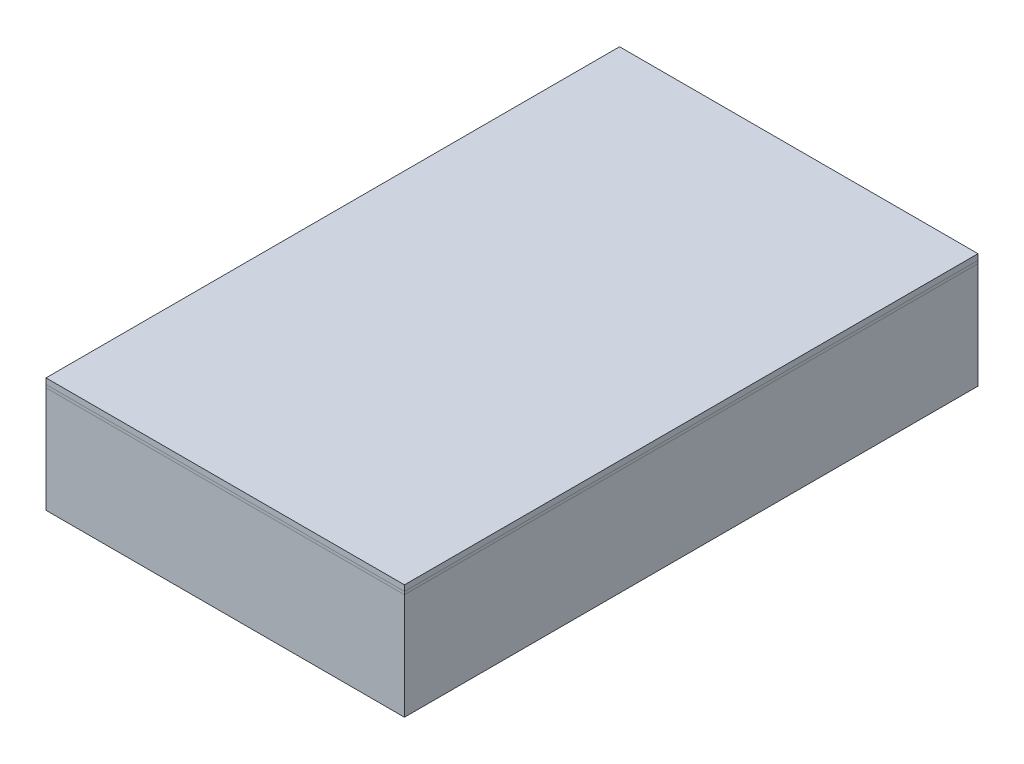
ISO-10303-21;
HEADER;
FILE_DESCRIPTION(('STEP AP214'),'2;1');
FILE_NAME('part.step','',(''),(''),'','','');
FILE_SCHEMA(('AUTOMOTIVE_DESIGN { 1 0 10303 214 1 1 1 1 }'));
ENDSEC;
DATA;
#1=APPLICATION_CONTEXT('core data for automotive mechanical design processes');
#2=APPLICATION_PROTOCOL_DEFINITION('international standard','automotive_design',2000,#1);
#3=PRODUCT_CONTEXT('',#1,'mechanical');
#4=PRODUCT('Part','Part','',(#3));
#5=PRODUCT_RELATED_PRODUCT_CATEGORY('part','',(#4));
#6=PRODUCT_DEFINITION_FORMATION('','',#4);
#7=PRODUCT_DEFINITION_CONTEXT('part definition',#1,'design');
#8=PRODUCT_DEFINITION('design','',#6,#7);
#9=PRODUCT_DEFINITION_SHAPE('','',#8);
#10=(LENGTH_UNIT() NAMED_UNIT(*) SI_UNIT(.MILLI.,.METRE.));
#11=(NAMED_UNIT(*) PLANE_ANGLE_UNIT() SI_UNIT($,.RADIAN.));
#12=(NAMED_UNIT(*) SI_UNIT($,.STERADIAN.) SOLID_ANGLE_UNIT());
#13=UNCERTAINTY_MEASURE_WITH_UNIT(LENGTH_MEASURE(1.E-05),#10,'distance_accuracy_value','');
#14=(GEOMETRIC_REPRESENTATION_CONTEXT(3) GLOBAL_UNCERTAINTY_ASSIGNED_CONTEXT((#13)) GLOBAL_UNIT_ASSIGNED_CONTEXT((#10,
#11,#12)) REPRESENTATION_CONTEXT('',''));
#15=CARTESIAN_POINT('',(0.,0.,0.));
#16=DIRECTION('',(0.,0.,1.));
#17=DIRECTION('',(1.,0.,0.));
#18=AXIS2_PLACEMENT_3D('',#15,#16,#17);
#19=CARTESIAN_POINT('',(-0.625,0.4,-1.));
#20=DIRECTION('',(1.,0.,0.));
#21=DIRECTION('',(0.,0.,-1.));
#22=AXIS2_PLACEMENT_3D('',#19,#20,#21);
#23=PLANE('',#22);
#24=DIRECTION('',(0.,0.,1.));
#25=VECTOR('',#24,1.);
#26=CARTESIAN_POINT('',(-0.625,0.38,-1.));
#27=LINE('',#26,#25);
#28=CARTESIAN_POINT('',(-0.625,0.38,-1.));
#29=VERTEX_POINT('',#28);
#30=CARTESIAN_POINT('',(-0.625,0.38,1.));
#31=VERTEX_POINT('',#30);
#32=EDGE_CURVE('E115',#29,#31,#27,.T.);
#33=ORIENTED_EDGE('',*,*,#32,.T.);
#34=DIRECTION('',(0.,-1.,0.));
#35=VECTOR('',#34,1.);
#36=CARTESIAN_POINT('',(-0.625,0.4,1.));
#37=LINE('',#36,#35);
#38=CARTESIAN_POINT('',(-0.625,0.4,1.));
#39=VERTEX_POINT('',#38);
#40=EDGE_CURVE('E12',#39,#31,#37,.T.);
#41=ORIENTED_EDGE('',*,*,#40,.F.);
#42=DIRECTION('',(0.,0.,1.));
#43=VECTOR('',#42,1.);
#44=CARTESIAN_POINT('',(-0.625,0.4,-1.));
#45=LINE('',#44,#43);
#46=CARTESIAN_POINT('',(-0.625,0.4,-1.));
#47=VERTEX_POINT('',#46);
#48=EDGE_CURVE('E103',#47,#39,#45,.T.);
#49=ORIENTED_EDGE('',*,*,#48,.F.);
#50=DIRECTION('',(0.,-1.,0.));
#51=VECTOR('',#50,1.);
#52=CARTESIAN_POINT('',(-0.625,0.4,-1.));
#53=LINE('',#52,#51);
#54=EDGE_CURVE('E111',#47,#29,#53,.T.);
#55=ORIENTED_EDGE('',*,*,#54,.T.);
#56=EDGE_LOOP('',(#33,#41,#49,#55));
#57=FACE_BOUND('',#56,.T.);
#58=ADVANCED_FACE('F52',(#57),#23,.F.);
#59=CARTESIAN_POINT('',(-0.625,0.4,1.));
#60=DIRECTION('',(0.,0.,-1.));
#61=DIRECTION('',(-1.,0.,0.));
#62=AXIS2_PLACEMENT_3D('',#59,#60,#61);
#63=PLANE('',#62);
#64=DIRECTION('',(1.,0.,0.));
#65=VECTOR('',#64,1.);
#66=CARTESIAN_POINT('',(-0.625,0.38,1.));
#67=LINE('',#66,#65);
#68=CARTESIAN_POINT('',(0.625,0.38,1.));
#69=VERTEX_POINT('',#68);
#70=EDGE_CURVE('E107',#31,#69,#67,.T.);
#71=ORIENTED_EDGE('',*,*,#70,.T.);
#72=DIRECTION('',(0.,-1.,0.));
#73=VECTOR('',#72,1.);
#74=CARTESIAN_POINT('',(0.625,0.4,1.));
#75=LINE('',#74,#73);
#76=CARTESIAN_POINT('',(0.625,0.4,1.));
#77=VERTEX_POINT('',#76);
#78=EDGE_CURVE('E60',#77,#69,#75,.T.);
#79=ORIENTED_EDGE('',*,*,#78,.F.);
#80=DIRECTION('',(1.,0.,0.));
#81=VECTOR('',#80,1.);
#82=CARTESIAN_POINT('',(-0.625,0.4,1.));
#83=LINE('',#82,#81);
#84=EDGE_CURVE('E98',#39,#77,#83,.T.);
#85=ORIENTED_EDGE('',*,*,#84,.F.);
#86=ORIENTED_EDGE('',*,*,#40,.T.);
#87=EDGE_LOOP('',(#71,#79,#85,#86));
#88=FACE_BOUND('',#87,.T.);
#89=ADVANCED_FACE('F106',(#88),#63,.F.);
#90=CARTESIAN_POINT('',(0.625,0.4,-1.));
#91=DIRECTION('',(-1.,0.,0.));
#92=DIRECTION('',(0.,0.,1.));
#93=AXIS2_PLACEMENT_3D('',#90,#91,#92);
#94=PLANE('',#93);
#95=DIRECTION('',(0.,0.,-1.));
#96=VECTOR('',#95,1.);
#97=CARTESIAN_POINT('',(0.625,0.38,-1.));
#98=LINE('',#97,#96);
#99=CARTESIAN_POINT('',(0.625,0.38,-1.));
#100=VERTEX_POINT('',#99);
#101=EDGE_CURVE('E85',#69,#100,#98,.T.);
#102=ORIENTED_EDGE('',*,*,#101,.T.);
#103=DIRECTION('',(0.,-1.,0.));
#104=VECTOR('',#103,1.);
#105=CARTESIAN_POINT('',(0.625,0.4,-1.));
#106=LINE('',#105,#104);
#107=CARTESIAN_POINT('',(0.625,0.4,-1.));
#108=VERTEX_POINT('',#107);
#109=EDGE_CURVE('E108',#108,#100,#106,.T.);
#110=ORIENTED_EDGE('',*,*,#109,.F.);
#111=DIRECTION('',(0.,0.,-1.));
#112=VECTOR('',#111,1.);
#113=CARTESIAN_POINT('',(0.625,0.4,-1.));
#114=LINE('',#113,#112);
#115=EDGE_CURVE('E101',#77,#108,#114,.T.);
#116=ORIENTED_EDGE('',*,*,#115,.F.);
#117=ORIENTED_EDGE('',*,*,#78,.T.);
#118=EDGE_LOOP('',(#102,#110,#116,#117));
#119=FACE_BOUND('',#118,.T.);
#120=ADVANCED_FACE('F109',(#119),#94,.F.);
#121=CARTESIAN_POINT('',(-0.625,0.4,-1.));
#122=DIRECTION('',(0.,0.,1.));
#123=DIRECTION('',(1.,0.,0.));
#124=AXIS2_PLACEMENT_3D('',#121,#122,#123);
#125=PLANE('',#124);
#126=DIRECTION('',(-1.,0.,0.));
#127=VECTOR('',#126,1.);
#128=CARTESIAN_POINT('',(-0.625,0.38,-1.));
#129=LINE('',#128,#127);
#130=EDGE_CURVE('E91',#100,#29,#129,.T.);
#131=ORIENTED_EDGE('',*,*,#130,.T.);
#132=ORIENTED_EDGE('',*,*,#54,.F.);
#133=DIRECTION('',(-1.,0.,0.));
#134=VECTOR('',#133,1.);
#135=CARTESIAN_POINT('',(-0.625,0.4,-1.));
#136=LINE('',#135,#134);
#137=EDGE_CURVE('E68',#108,#47,#136,.T.);
#138=ORIENTED_EDGE('',*,*,#137,.F.);
#139=ORIENTED_EDGE('',*,*,#109,.T.);
#140=EDGE_LOOP('',(#131,#132,#138,#139));
#141=FACE_BOUND('',#140,.T.);
#142=ADVANCED_FACE('F122',(#141),#125,.F.);
#143=CARTESIAN_POINT('',(0.,0.4,0.));
#144=DIRECTION('',(0.,1.,0.));
#145=DIRECTION('',(0.,0.,1.));
#146=AXIS2_PLACEMENT_3D('',#143,#144,#145);
#147=PLANE('',#146);
#148=ORIENTED_EDGE('',*,*,#48,.T.);
#149=ORIENTED_EDGE('',*,*,#84,.T.);
#150=ORIENTED_EDGE('',*,*,#115,.T.);
#151=ORIENTED_EDGE('',*,*,#137,.T.);
#152=EDGE_LOOP('',(#148,#149,#150,#151));
#153=FACE_BOUND('',#152,.T.);
#154=ADVANCED_FACE('F99',(#153),#147,.T.);
#155=CARTESIAN_POINT('',(0.,0.38,0.));
#156=DIRECTION('',(0.,1.,0.));
#157=DIRECTION('',(0.,0.,1.));
#158=AXIS2_PLACEMENT_3D('',#155,#156,#157);
#159=PLANE('',#158);
#160=ORIENTED_EDGE('',*,*,#32,.F.);
#161=ORIENTED_EDGE('',*,*,#130,.F.);
#162=ORIENTED_EDGE('',*,*,#101,.F.);
#163=ORIENTED_EDGE('',*,*,#70,.F.);
#164=EDGE_LOOP('',(#160,#161,#162,#163));
#165=FACE_BOUND('',#164,.T.);
#166=ADVANCED_FACE('F125',(#165),#159,.F.);
#167=CLOSED_SHELL('',(#58,#89,#120,#142,#154,#166));
#168=MANIFOLD_SOLID_BREP('B2',#167);
#169=CARTESIAN_POINT('',(-0.625,0.38,1.));
#170=DIRECTION('',(1.,0.,0.));
#171=DIRECTION('',(0.,0.,-1.));
#172=AXIS2_PLACEMENT_3D('',#169,#170,#171);
#173=PLANE('',#172);
#174=DIRECTION('',(0.,0.,1.));
#175=VECTOR('',#174,1.);
#176=CARTESIAN_POINT('',(-0.625,0.37,1.));
#177=LINE('',#176,#175);
#178=CARTESIAN_POINT('',(-0.625,0.37,-1.));
#179=VERTEX_POINT('',#178);
#180=CARTESIAN_POINT('',(-0.625,0.37,1.));
#181=VERTEX_POINT('',#180);
#182=EDGE_CURVE('E272',#179,#181,#177,.T.);
#183=ORIENTED_EDGE('',*,*,#182,.T.);
#184=DIRECTION('',(0.,-1.,0.));
#185=VECTOR('',#184,1.);
#186=CARTESIAN_POINT('',(-0.625,0.38,1.));
#187=LINE('',#186,#185);
#188=CARTESIAN_POINT('',(-0.625,0.38,1.));
#189=VERTEX_POINT('',#188);
#190=EDGE_CURVE('E50',#189,#181,#187,.T.);
#191=ORIENTED_EDGE('',*,*,#190,.F.);
#192=DIRECTION('',(0.,0.,1.));
#193=VECTOR('',#192,1.);
#194=CARTESIAN_POINT('',(-0.625,0.38,1.));
#195=LINE('',#194,#193);
#196=CARTESIAN_POINT('',(-0.625,0.38,-1.));
#197=VERTEX_POINT('',#196);
#198=EDGE_CURVE('E260',#197,#189,#195,.T.);
#199=ORIENTED_EDGE('',*,*,#198,.F.);
#200=DIRECTION('',(0.,-1.,0.));
#201=VECTOR('',#200,1.);
#202=CARTESIAN_POINT('',(-0.625,0.38,-1.));
#203=LINE('',#202,#201);
#204=EDGE_CURVE('E268',#197,#179,#203,.T.);
#205=ORIENTED_EDGE('',*,*,#204,.T.);
#206=EDGE_LOOP('',(#183,#191,#199,#205));
#207=FACE_BOUND('',#206,.T.);
#208=ADVANCED_FACE('F209',(#207),#173,.F.);
#209=CARTESIAN_POINT('',(-0.625,0.38,1.));
#210=DIRECTION('',(0.,0.,-1.));
#211=DIRECTION('',(-1.,0.,0.));
#212=AXIS2_PLACEMENT_3D('',#209,#210,#211);
#213=PLANE('',#212);
#214=DIRECTION('',(1.,0.,0.));
#215=VECTOR('',#214,1.);
#216=CARTESIAN_POINT('',(-0.625,0.37,1.));
#217=LINE('',#216,#215);
#218=CARTESIAN_POINT('',(0.625,0.37,1.));
#219=VERTEX_POINT('',#218);
#220=EDGE_CURVE('E264',#181,#219,#217,.T.);
#221=ORIENTED_EDGE('',*,*,#220,.T.);
#222=DIRECTION('',(0.,-1.,0.));
#223=VECTOR('',#222,1.);
#224=CARTESIAN_POINT('',(0.625,0.38,1.));
#225=LINE('',#224,#223);
#226=CARTESIAN_POINT('',(0.625,0.38,1.));
#227=VERTEX_POINT('',#226);
#228=EDGE_CURVE('E217',#227,#219,#225,.T.);
#229=ORIENTED_EDGE('',*,*,#228,.F.);
#230=DIRECTION('',(1.,0.,0.));
#231=VECTOR('',#230,1.);
#232=CARTESIAN_POINT('',(-0.625,0.38,1.));
#233=LINE('',#232,#231);
#234=EDGE_CURVE('E255',#189,#227,#233,.T.);
#235=ORIENTED_EDGE('',*,*,#234,.F.);
#236=ORIENTED_EDGE('',*,*,#190,.T.);
#237=EDGE_LOOP('',(#221,#229,#235,#236));
#238=FACE_BOUND('',#237,.T.);
#239=ADVANCED_FACE('F263',(#238),#213,.F.);
#240=CARTESIAN_POINT('',(0.625,0.38,1.));
#241=DIRECTION('',(-1.,0.,0.));
#242=DIRECTION('',(0.,0.,1.));
#243=AXIS2_PLACEMENT_3D('',#240,#241,#242);
#244=PLANE('',#243);
#245=DIRECTION('',(0.,0.,-1.));
#246=VECTOR('',#245,1.);
#247=CARTESIAN_POINT('',(0.625,0.37,1.));
#248=LINE('',#247,#246);
#249=CARTESIAN_POINT('',(0.625,0.37,-1.));
#250=VERTEX_POINT('',#249);
#251=EDGE_CURVE('E242',#219,#250,#248,.T.);
#252=ORIENTED_EDGE('',*,*,#251,.T.);
#253=DIRECTION('',(0.,-1.,0.));
#254=VECTOR('',#253,1.);
#255=CARTESIAN_POINT('',(0.625,0.38,-1.));
#256=LINE('',#255,#254);
#257=CARTESIAN_POINT('',(0.625,0.38,-1.));
#258=VERTEX_POINT('',#257);
#259=EDGE_CURVE('E265',#258,#250,#256,.T.);
#260=ORIENTED_EDGE('',*,*,#259,.F.);
#261=DIRECTION('',(0.,0.,-1.));
#262=VECTOR('',#261,1.);
#263=CARTESIAN_POINT('',(0.625,0.38,1.));
#264=LINE('',#263,#262);
#265=EDGE_CURVE('E258',#227,#258,#264,.T.);
#266=ORIENTED_EDGE('',*,*,#265,.F.);
#267=ORIENTED_EDGE('',*,*,#228,.T.);
#268=EDGE_LOOP('',(#252,#260,#266,#267));
#269=FACE_BOUND('',#268,.T.);
#270=ADVANCED_FACE('F266',(#269),#244,.F.);
#271=CARTESIAN_POINT('',(-0.625,0.38,-1.));
#272=DIRECTION('',(0.,0.,1.));
#273=DIRECTION('',(1.,0.,0.));
#274=AXIS2_PLACEMENT_3D('',#271,#272,#273);
#275=PLANE('',#274);
#276=DIRECTION('',(-1.,0.,0.));
#277=VECTOR('',#276,1.);
#278=CARTESIAN_POINT('',(-0.625,0.37,-1.));
#279=LINE('',#278,#277);
#280=EDGE_CURVE('E248',#250,#179,#279,.T.);
#281=ORIENTED_EDGE('',*,*,#280,.T.);
#282=ORIENTED_EDGE('',*,*,#204,.F.);
#283=DIRECTION('',(-1.,0.,0.));
#284=VECTOR('',#283,1.);
#285=CARTESIAN_POINT('',(-0.625,0.38,-1.));
#286=LINE('',#285,#284);
#287=EDGE_CURVE('E225',#258,#197,#286,.T.);
#288=ORIENTED_EDGE('',*,*,#287,.F.);
#289=ORIENTED_EDGE('',*,*,#259,.T.);
#290=EDGE_LOOP('',(#281,#282,#288,#289));
#291=FACE_BOUND('',#290,.T.);
#292=ADVANCED_FACE('F279',(#291),#275,.F.);
#293=CARTESIAN_POINT('',(0.,0.38,0.));
#294=DIRECTION('',(0.,-1.,0.));
#295=DIRECTION('',(0.,0.,-1.));
#296=AXIS2_PLACEMENT_3D('',#293,#294,#295);
#297=PLANE('',#296);
#298=ORIENTED_EDGE('',*,*,#198,.T.);
#299=ORIENTED_EDGE('',*,*,#234,.T.);
#300=ORIENTED_EDGE('',*,*,#265,.T.);
#301=ORIENTED_EDGE('',*,*,#287,.T.);
#302=EDGE_LOOP('',(#298,#299,#300,#301));
#303=FACE_BOUND('',#302,.T.);
#304=ADVANCED_FACE('F256',(#303),#297,.F.);
#305=CARTESIAN_POINT('',(0.,0.37,0.));
#306=DIRECTION('',(0.,-1.,0.));
#307=DIRECTION('',(0.,0.,-1.));
#308=AXIS2_PLACEMENT_3D('',#305,#306,#307);
#309=PLANE('',#308);
#310=ORIENTED_EDGE('',*,*,#182,.F.);
#311=ORIENTED_EDGE('',*,*,#280,.F.);
#312=ORIENTED_EDGE('',*,*,#251,.F.);
#313=ORIENTED_EDGE('',*,*,#220,.F.);
#314=EDGE_LOOP('',(#310,#311,#312,#313));
#315=FACE_BOUND('',#314,.T.);
#316=ADVANCED_FACE('F282',(#315),#309,.T.);
#317=CLOSED_SHELL('',(#208,#239,#270,#292,#304,#316));
#318=MANIFOLD_SOLID_BREP('B6',#317);
#319=CARTESIAN_POINT('',(0.625,0.37,1.));
#320=DIRECTION('',(-1.,0.,0.));
#321=DIRECTION('',(0.,0.,1.));
#322=AXIS2_PLACEMENT_3D('',#319,#320,#321);
#323=PLANE('',#322);
#324=DIRECTION('',(0.,0.,-1.));
#325=VECTOR('',#324,1.);
#326=CARTESIAN_POINT('',(0.625,0.,1.));
#327=LINE('',#326,#325);
#328=CARTESIAN_POINT('',(0.625,0.,1.));
#329=VERTEX_POINT('',#328);
#330=CARTESIAN_POINT('',(0.625,0.,-1.));
#331=VERTEX_POINT('',#330);
#332=EDGE_CURVE('E418',#329,#331,#327,.T.);
#333=ORIENTED_EDGE('',*,*,#332,.T.);
#334=DIRECTION('',(0.,-1.,0.));
#335=VECTOR('',#334,1.);
#336=CARTESIAN_POINT('',(0.625,0.37,-1.));
#337=LINE('',#336,#335);
#338=CARTESIAN_POINT('',(0.625,0.37,-1.));
#339=VERTEX_POINT('',#338);
#340=EDGE_CURVE('E207',#339,#331,#337,.T.);
#341=ORIENTED_EDGE('',*,*,#340,.F.);
#342=DIRECTION('',(0.,0.,-1.));
#343=VECTOR('',#342,1.);
#344=CARTESIAN_POINT('',(0.625,0.37,1.));
#345=LINE('',#344,#343);
#346=CARTESIAN_POINT('',(0.625,0.37,1.));
#347=VERTEX_POINT('',#346);
#348=EDGE_CURVE('E406',#347,#339,#345,.T.);
#349=ORIENTED_EDGE('',*,*,#348,.F.);
#350=DIRECTION('',(0.,-1.,0.));
#351=VECTOR('',#350,1.);
#352=CARTESIAN_POINT('',(0.625,0.37,1.));
#353=LINE('',#352,#351);
#354=EDGE_CURVE('E414',#347,#329,#353,.T.);
#355=ORIENTED_EDGE('',*,*,#354,.T.);
#356=EDGE_LOOP('',(#333,#341,#349,#355));
#357=FACE_BOUND('',#356,.T.);
#358=ADVANCED_FACE('F355',(#357),#323,.F.);
#359=CARTESIAN_POINT('',(-0.625,0.37,-1.));
#360=DIRECTION('',(0.,0.,1.));
#361=DIRECTION('',(1.,0.,0.));
#362=AXIS2_PLACEMENT_3D('',#359,#360,#361);
#363=PLANE('',#362);
#364=DIRECTION('',(-1.,0.,0.));
#365=VECTOR('',#364,1.);
#366=CARTESIAN_POINT('',(-0.625,0.,-1.));
#367=LINE('',#366,#365);
#368=CARTESIAN_POINT('',(-0.625,0.,-1.));
#369=VERTEX_POINT('',#368);
#370=EDGE_CURVE('E410',#331,#369,#367,.T.);
#371=ORIENTED_EDGE('',*,*,#370,.T.);
#372=DIRECTION('',(0.,-1.,0.));
#373=VECTOR('',#372,1.);
#374=CARTESIAN_POINT('',(-0.625,0.37,-1.));
#375=LINE('',#374,#373);
#376=CARTESIAN_POINT('',(-0.625,0.37,-1.));
#377=VERTEX_POINT('',#376);
#378=EDGE_CURVE('E363',#377,#369,#375,.T.);
#379=ORIENTED_EDGE('',*,*,#378,.F.);
#380=DIRECTION('',(-1.,0.,0.));
#381=VECTOR('',#380,1.);
#382=CARTESIAN_POINT('',(-0.625,0.37,-1.));
#383=LINE('',#382,#381);
#384=EDGE_CURVE('E401',#339,#377,#383,.T.);
#385=ORIENTED_EDGE('',*,*,#384,.F.);
#386=ORIENTED_EDGE('',*,*,#340,.T.);
#387=EDGE_LOOP('',(#371,#379,#385,#386));
#388=FACE_BOUND('',#387,.T.);
#389=ADVANCED_FACE('F409',(#388),#363,.F.);
#390=CARTESIAN_POINT('',(-0.625,0.37,1.));
#391=DIRECTION('',(1.,0.,0.));
#392=DIRECTION('',(0.,0.,-1.));
#393=AXIS2_PLACEMENT_3D('',#390,#391,#392);
#394=PLANE('',#393);
#395=DIRECTION('',(0.,0.,1.));
#396=VECTOR('',#395,1.);
#397=CARTESIAN_POINT('',(-0.625,0.,1.));
#398=LINE('',#397,#396);
#399=CARTESIAN_POINT('',(-0.625,0.,1.));
#400=VERTEX_POINT('',#399);
#401=EDGE_CURVE('E388',#369,#400,#398,.T.);
#402=ORIENTED_EDGE('',*,*,#401,.T.);
#403=DIRECTION('',(0.,-1.,0.));
#404=VECTOR('',#403,1.);
#405=CARTESIAN_POINT('',(-0.625,0.37,1.));
#406=LINE('',#405,#404);
#407=CARTESIAN_POINT('',(-0.625,0.37,1.));
#408=VERTEX_POINT('',#407);
#409=EDGE_CURVE('E411',#408,#400,#406,.T.);
#410=ORIENTED_EDGE('',*,*,#409,.F.);
#411=DIRECTION('',(0.,0.,1.));
#412=VECTOR('',#411,1.);
#413=CARTESIAN_POINT('',(-0.625,0.37,1.));
#414=LINE('',#413,#412);
#415=EDGE_CURVE('E404',#377,#408,#414,.T.);
#416=ORIENTED_EDGE('',*,*,#415,.F.);
#417=ORIENTED_EDGE('',*,*,#378,.T.);
#418=EDGE_LOOP('',(#402,#410,#416,#417));
#419=FACE_BOUND('',#418,.T.);
#420=ADVANCED_FACE('F412',(#419),#394,.F.);
#421=CARTESIAN_POINT('',(-0.625,0.37,1.));
#422=DIRECTION('',(0.,0.,-1.));
#423=DIRECTION('',(-1.,0.,0.));
#424=AXIS2_PLACEMENT_3D('',#421,#422,#423);
#425=PLANE('',#424);
#426=DIRECTION('',(1.,0.,0.));
#427=VECTOR('',#426,1.);
#428=CARTESIAN_POINT('',(-0.625,0.,1.));
#429=LINE('',#428,#427);
#430=EDGE_CURVE('E394',#400,#329,#429,.T.);
#431=ORIENTED_EDGE('',*,*,#430,.T.);
#432=ORIENTED_EDGE('',*,*,#354,.F.);
#433=DIRECTION('',(1.,0.,0.));
#434=VECTOR('',#433,1.);
#435=CARTESIAN_POINT('',(-0.625,0.37,1.));
#436=LINE('',#435,#434);
#437=EDGE_CURVE('E371',#408,#347,#436,.T.);
#438=ORIENTED_EDGE('',*,*,#437,.F.);
#439=ORIENTED_EDGE('',*,*,#409,.T.);
#440=EDGE_LOOP('',(#431,#432,#438,#439));
#441=FACE_BOUND('',#440,.T.);
#442=ADVANCED_FACE('F425',(#441),#425,.F.);
#443=CARTESIAN_POINT('',(0.,0.37,0.));
#444=DIRECTION('',(0.,-1.,0.));
#445=DIRECTION('',(0.,0.,-1.));
#446=AXIS2_PLACEMENT_3D('',#443,#444,#445);
#447=PLANE('',#446);
#448=ORIENTED_EDGE('',*,*,#348,.T.);
#449=ORIENTED_EDGE('',*,*,#384,.T.);
#450=ORIENTED_EDGE('',*,*,#415,.T.);
#451=ORIENTED_EDGE('',*,*,#437,.T.);
#452=EDGE_LOOP('',(#448,#449,#450,#451));
#453=FACE_BOUND('',#452,.T.);
#454=ADVANCED_FACE('F402',(#453),#447,.F.);
#455=CARTESIAN_POINT('',(0.,0.,0.));
#456=DIRECTION('',(0.,-1.,0.));
#457=DIRECTION('',(0.,0.,-1.));
#458=AXIS2_PLACEMENT_3D('',#455,#456,#457);
#459=PLANE('',#458);
#460=ORIENTED_EDGE('',*,*,#332,.F.);
#461=ORIENTED_EDGE('',*,*,#430,.F.);
#462=ORIENTED_EDGE('',*,*,#401,.F.);
#463=ORIENTED_EDGE('',*,*,#370,.F.);
#464=EDGE_LOOP('',(#460,#461,#462,#463));
#465=FACE_BOUND('',#464,.T.);
#466=ADVANCED_FACE('F428',(#465),#459,.T.);
#467=CLOSED_SHELL('',(#358,#389,#420,#442,#454,#466));
#468=MANIFOLD_SOLID_BREP('B44',#467);
#469=ADVANCED_BREP_SHAPE_REPRESENTATION('',(#18,#168,#318,#468),#14);
#470=SHAPE_DEFINITION_REPRESENTATION(#9,#469);
ENDSEC;
END-ISO-10303-21;
